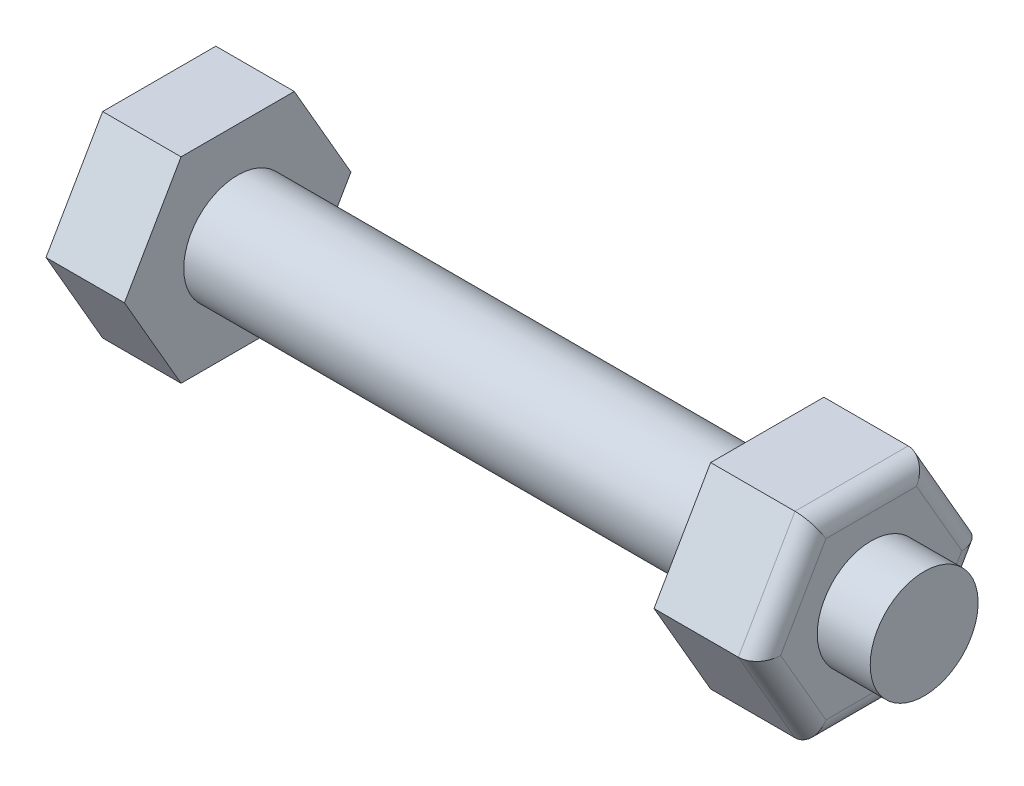
ISO-10303-21;
HEADER;
FILE_DESCRIPTION(('STEP AP214'),'2;1');
FILE_NAME('part.step','',(''),(''),'','','');
FILE_SCHEMA(('AUTOMOTIVE_DESIGN { 1 0 10303 214 1 1 1 1 }'));
ENDSEC;
DATA;
#1=APPLICATION_CONTEXT('core data for automotive mechanical design processes');
#2=APPLICATION_PROTOCOL_DEFINITION('international standard','automotive_design',2000,#1);
#3=PRODUCT_CONTEXT('',#1,'mechanical');
#4=PRODUCT('Part','Part','',(#3));
#5=PRODUCT_RELATED_PRODUCT_CATEGORY('part','',(#4));
#6=PRODUCT_DEFINITION_FORMATION('','',#4);
#7=PRODUCT_DEFINITION_CONTEXT('part definition',#1,'design');
#8=PRODUCT_DEFINITION('design','',#6,#7);
#9=PRODUCT_DEFINITION_SHAPE('','',#8);
#10=(LENGTH_UNIT() NAMED_UNIT(*) SI_UNIT(.MILLI.,.METRE.));
#11=(NAMED_UNIT(*) PLANE_ANGLE_UNIT() SI_UNIT($,.RADIAN.));
#12=(NAMED_UNIT(*) SI_UNIT($,.STERADIAN.) SOLID_ANGLE_UNIT());
#13=UNCERTAINTY_MEASURE_WITH_UNIT(LENGTH_MEASURE(1.E-05),#10,'distance_accuracy_value','');
#14=(GEOMETRIC_REPRESENTATION_CONTEXT(3) GLOBAL_UNCERTAINTY_ASSIGNED_CONTEXT((#13)) GLOBAL_UNIT_ASSIGNED_CONTEXT((#10,
#11,#12)) REPRESENTATION_CONTEXT('',''));
#15=CARTESIAN_POINT('',(0.,0.,0.));
#16=DIRECTION('',(0.,0.,1.));
#17=DIRECTION('',(1.,0.,0.));
#18=AXIS2_PLACEMENT_3D('',#15,#16,#17);
#19=CARTESIAN_POINT('',(0.,0.,0.));
#20=DIRECTION('',(-1.,0.,0.));
#21=DIRECTION('',(0.,0.,1.));
#22=AXIS2_PLACEMENT_3D('',#19,#20,#21);
#23=CYLINDRICAL_SURFACE('',#22,2.75);
#24=CARTESIAN_POINT('',(0.,0.,0.));
#25=DIRECTION('',(-1.,0.,0.));
#26=DIRECTION('',(0.,0.,1.));
#27=AXIS2_PLACEMENT_3D('',#24,#25,#26);
#28=CIRCLE('',#27,2.75);
#29=CARTESIAN_POINT('',(0.,0.,2.75));
#30=VERTEX_POINT('',#29);
#31=EDGE_CURVE('E286',#30,#30,#28,.T.);
#32=ORIENTED_EDGE('',*,*,#31,.F.);
#33=EDGE_LOOP('',(#32));
#34=FACE_BOUND('',#33,.T.);
#35=CARTESIAN_POINT('',(27.,0.,0.));
#36=DIRECTION('',(1.,0.,0.));
#37=DIRECTION('',(0.,0.,-1.));
#38=AXIS2_PLACEMENT_3D('',#35,#36,#37);
#39=CIRCLE('',#38,2.75);
#40=CARTESIAN_POINT('',(27.,0.,-2.75));
#41=VERTEX_POINT('',#40);
#42=EDGE_CURVE('E290',#41,#41,#39,.T.);
#43=ORIENTED_EDGE('',*,*,#42,.F.);
#44=EDGE_LOOP('',(#43));
#45=FACE_BOUND('',#44,.T.);
#46=ADVANCED_FACE('F45',(#34,#45),#23,.T.);
#47=CARTESIAN_POINT('',(-4.,-5.,-2.88675134594813));
#48=DIRECTION('',(0.,-0.5,-0.866025403784439));
#49=DIRECTION('',(0.,0.866025403784439,-0.5));
#50=AXIS2_PLACEMENT_3D('',#47,#48,#49);
#51=PLANE('',#50);
#52=DIRECTION('',(0.,0.866025403784439,-0.5));
#53=VECTOR('',#52,1.);
#54=CARTESIAN_POINT('',(0.,-5.,-2.88675134594813));
#55=LINE('',#54,#53);
#56=CARTESIAN_POINT('',(0.,-5.,-2.88675134594813));
#57=VERTEX_POINT('',#56);
#58=CARTESIAN_POINT('',(0.,0.,-5.77350269189626));
#59=VERTEX_POINT('',#58);
#60=EDGE_CURVE('E242',#57,#59,#55,.T.);
#61=ORIENTED_EDGE('',*,*,#60,.F.);
#62=DIRECTION('',(1.,0.,0.));
#63=VECTOR('',#62,1.);
#64=CARTESIAN_POINT('',(-4.,-5.,-2.88675134594813));
#65=LINE('',#64,#63);
#66=CARTESIAN_POINT('',(-4.,-5.,-2.88675134594813));
#67=VERTEX_POINT('',#66);
#68=EDGE_CURVE('E265',#67,#57,#65,.T.);
#69=ORIENTED_EDGE('',*,*,#68,.F.);
#70=DIRECTION('',(0.,0.866025403784439,-0.5));
#71=VECTOR('',#70,1.);
#72=CARTESIAN_POINT('',(-4.,-5.,-2.88675134594813));
#73=LINE('',#72,#71);
#74=CARTESIAN_POINT('',(-4.,0.,-5.77350269189626));
#75=VERTEX_POINT('',#74);
#76=EDGE_CURVE('E216',#67,#75,#73,.T.);
#77=ORIENTED_EDGE('',*,*,#76,.T.);
#78=DIRECTION('',(1.,0.,0.));
#79=VECTOR('',#78,1.);
#80=CARTESIAN_POINT('',(-4.,0.,-5.77350269189626));
#81=LINE('',#80,#79);
#82=EDGE_CURVE('E241',#75,#59,#81,.T.);
#83=ORIENTED_EDGE('',*,*,#82,.T.);
#84=EDGE_LOOP('',(#61,#69,#77,#83));
#85=FACE_BOUND('',#84,.T.);
#86=ADVANCED_FACE('F385',(#85),#51,.T.);
#87=CARTESIAN_POINT('',(-4.,-5.,2.88675134594813));
#88=DIRECTION('',(0.,-1.,0.));
#89=DIRECTION('',(0.,0.,-1.));
#90=AXIS2_PLACEMENT_3D('',#87,#88,#89);
#91=PLANE('',#90);
#92=DIRECTION('',(0.,0.,-1.));
#93=VECTOR('',#92,1.);
#94=CARTESIAN_POINT('',(0.,-5.,2.88675134594813));
#95=LINE('',#94,#93);
#96=CARTESIAN_POINT('',(0.,-5.,2.88675134594813));
#97=VERTEX_POINT('',#96);
#98=EDGE_CURVE('E221',#97,#57,#95,.T.);
#99=ORIENTED_EDGE('',*,*,#98,.F.);
#100=DIRECTION('',(1.,0.,0.));
#101=VECTOR('',#100,1.);
#102=CARTESIAN_POINT('',(-4.,-5.,2.88675134594813));
#103=LINE('',#102,#101);
#104=CARTESIAN_POINT('',(-4.,-5.,2.88675134594813));
#105=VERTEX_POINT('',#104);
#106=EDGE_CURVE('E269',#105,#97,#103,.T.);
#107=ORIENTED_EDGE('',*,*,#106,.F.);
#108=DIRECTION('',(0.,0.,-1.));
#109=VECTOR('',#108,1.);
#110=CARTESIAN_POINT('',(-4.,-5.,2.88675134594813));
#111=LINE('',#110,#109);
#112=EDGE_CURVE('E237',#105,#67,#111,.T.);
#113=ORIENTED_EDGE('',*,*,#112,.T.);
#114=ORIENTED_EDGE('',*,*,#68,.T.);
#115=EDGE_LOOP('',(#99,#107,#113,#114));
#116=FACE_BOUND('',#115,.T.);
#117=ADVANCED_FACE('F391',(#116),#91,.T.);
#118=CARTESIAN_POINT('',(-4.,0.,5.77350269189626));
#119=DIRECTION('',(0.,-0.5,0.866025403784439));
#120=DIRECTION('',(0.,-0.866025403784439,-0.5));
#121=AXIS2_PLACEMENT_3D('',#118,#119,#120);
#122=PLANE('',#121);
#123=DIRECTION('',(0.,-0.866025403784439,-0.5));
#124=VECTOR('',#123,1.);
#125=CARTESIAN_POINT('',(0.,0.,5.77350269189626));
#126=LINE('',#125,#124);
#127=CARTESIAN_POINT('',(0.,0.,5.77350269189626));
#128=VERTEX_POINT('',#127);
#129=EDGE_CURVE('E258',#128,#97,#126,.T.);
#130=ORIENTED_EDGE('',*,*,#129,.F.);
#131=DIRECTION('',(1.,0.,0.));
#132=VECTOR('',#131,1.);
#133=CARTESIAN_POINT('',(-4.,0.,5.77350269189626));
#134=LINE('',#133,#132);
#135=CARTESIAN_POINT('',(-4.,0.,5.77350269189626));
#136=VERTEX_POINT('',#135);
#137=EDGE_CURVE('E272',#136,#128,#134,.T.);
#138=ORIENTED_EDGE('',*,*,#137,.F.);
#139=DIRECTION('',(0.,-0.866025403784439,-0.5));
#140=VECTOR('',#139,1.);
#141=CARTESIAN_POINT('',(-4.,0.,5.77350269189626));
#142=LINE('',#141,#140);
#143=EDGE_CURVE('E233',#136,#105,#142,.T.);
#144=ORIENTED_EDGE('',*,*,#143,.T.);
#145=ORIENTED_EDGE('',*,*,#106,.T.);
#146=EDGE_LOOP('',(#130,#138,#144,#145));
#147=FACE_BOUND('',#146,.T.);
#148=ADVANCED_FACE('F441',(#147),#122,.T.);
#149=CARTESIAN_POINT('',(-4.,5.,2.88675134594813));
#150=DIRECTION('',(0.,0.5,0.866025403784439));
#151=DIRECTION('',(0.,-0.866025403784439,0.5));
#152=AXIS2_PLACEMENT_3D('',#149,#150,#151);
#153=PLANE('',#152);
#154=DIRECTION('',(0.,-0.866025403784439,0.5));
#155=VECTOR('',#154,1.);
#156=CARTESIAN_POINT('',(0.,5.,2.88675134594813));
#157=LINE('',#156,#155);
#158=CARTESIAN_POINT('',(0.,5.,2.88675134594813));
#159=VERTEX_POINT('',#158);
#160=EDGE_CURVE('E254',#159,#128,#157,.T.);
#161=ORIENTED_EDGE('',*,*,#160,.F.);
#162=DIRECTION('',(1.,0.,0.));
#163=VECTOR('',#162,1.);
#164=CARTESIAN_POINT('',(-4.,5.,2.88675134594813));
#165=LINE('',#164,#163);
#166=CARTESIAN_POINT('',(-4.,5.,2.88675134594813));
#167=VERTEX_POINT('',#166);
#168=EDGE_CURVE('E275',#167,#159,#165,.T.);
#169=ORIENTED_EDGE('',*,*,#168,.F.);
#170=DIRECTION('',(0.,-0.866025403784439,0.5));
#171=VECTOR('',#170,1.);
#172=CARTESIAN_POINT('',(-4.,5.,2.88675134594813));
#173=LINE('',#172,#171);
#174=EDGE_CURVE('E229',#167,#136,#173,.T.);
#175=ORIENTED_EDGE('',*,*,#174,.T.);
#176=ORIENTED_EDGE('',*,*,#137,.T.);
#177=EDGE_LOOP('',(#161,#169,#175,#176));
#178=FACE_BOUND('',#177,.T.);
#179=ADVANCED_FACE('F445',(#178),#153,.T.);
#180=CARTESIAN_POINT('',(-4.,5.,-2.88675134594813));
#181=DIRECTION('',(0.,1.,0.));
#182=DIRECTION('',(0.,0.,1.));
#183=AXIS2_PLACEMENT_3D('',#180,#181,#182);
#184=PLANE('',#183);
#185=DIRECTION('',(0.,0.,1.));
#186=VECTOR('',#185,1.);
#187=CARTESIAN_POINT('',(0.,5.,-2.88675134594813));
#188=LINE('',#187,#186);
#189=CARTESIAN_POINT('',(0.,5.,-2.88675134594813));
#190=VERTEX_POINT('',#189);
#191=EDGE_CURVE('E250',#190,#159,#188,.T.);
#192=ORIENTED_EDGE('',*,*,#191,.F.);
#193=DIRECTION('',(1.,0.,0.));
#194=VECTOR('',#193,1.);
#195=CARTESIAN_POINT('',(-4.,5.,-2.88675134594813));
#196=LINE('',#195,#194);
#197=CARTESIAN_POINT('',(-4.,5.,-2.88675134594813));
#198=VERTEX_POINT('',#197);
#199=EDGE_CURVE('E278',#198,#190,#196,.T.);
#200=ORIENTED_EDGE('',*,*,#199,.F.);
#201=DIRECTION('',(0.,0.,1.));
#202=VECTOR('',#201,1.);
#203=CARTESIAN_POINT('',(-4.,5.,-2.88675134594813));
#204=LINE('',#203,#202);
#205=EDGE_CURVE('E225',#198,#167,#204,.T.);
#206=ORIENTED_EDGE('',*,*,#205,.T.);
#207=ORIENTED_EDGE('',*,*,#168,.T.);
#208=EDGE_LOOP('',(#192,#200,#206,#207));
#209=FACE_BOUND('',#208,.T.);
#210=ADVANCED_FACE('F449',(#209),#184,.T.);
#211=CARTESIAN_POINT('',(-4.,0.,-5.77350269189626));
#212=DIRECTION('',(0.,0.5,-0.866025403784438));
#213=DIRECTION('',(0.,0.866025403784438,0.5));
#214=AXIS2_PLACEMENT_3D('',#211,#212,#213);
#215=PLANE('',#214);
#216=DIRECTION('',(0.,0.866025403784438,0.5));
#217=VECTOR('',#216,1.);
#218=CARTESIAN_POINT('',(0.,0.,-5.77350269189626));
#219=LINE('',#218,#217);
#220=EDGE_CURVE('E246',#59,#190,#219,.T.);
#221=ORIENTED_EDGE('',*,*,#220,.F.);
#222=ORIENTED_EDGE('',*,*,#82,.F.);
#223=DIRECTION('',(0.,0.866025403784438,0.5));
#224=VECTOR('',#223,1.);
#225=CARTESIAN_POINT('',(-4.,0.,-5.77350269189626));
#226=LINE('',#225,#224);
#227=EDGE_CURVE('E220',#75,#198,#226,.T.);
#228=ORIENTED_EDGE('',*,*,#227,.T.);
#229=ORIENTED_EDGE('',*,*,#199,.T.);
#230=EDGE_LOOP('',(#221,#222,#228,#229));
#231=FACE_BOUND('',#230,.T.);
#232=ADVANCED_FACE('F434',(#231),#215,.T.);
#233=CARTESIAN_POINT('',(-4.,0.,0.));
#234=DIRECTION('',(1.,0.,0.));
#235=DIRECTION('',(0.,0.,-1.));
#236=AXIS2_PLACEMENT_3D('',#233,#234,#235);
#237=PLANE('',#236);
#238=ORIENTED_EDGE('',*,*,#76,.F.);
#239=ORIENTED_EDGE('',*,*,#112,.F.);
#240=ORIENTED_EDGE('',*,*,#143,.F.);
#241=ORIENTED_EDGE('',*,*,#174,.F.);
#242=ORIENTED_EDGE('',*,*,#205,.F.);
#243=ORIENTED_EDGE('',*,*,#227,.F.);
#244=EDGE_LOOP('',(#238,#239,#240,#241,#242,#243));
#245=FACE_BOUND('',#244,.T.);
#246=ADVANCED_FACE('F431',(#245),#237,.F.);
#247=CARTESIAN_POINT('',(0.,0.,0.));
#248=DIRECTION('',(1.,0.,0.));
#249=DIRECTION('',(0.,0.,-1.));
#250=AXIS2_PLACEMENT_3D('',#247,#248,#249);
#251=PLANE('',#250);
#252=ORIENTED_EDGE('',*,*,#31,.T.);
#253=EDGE_LOOP('',(#252));
#254=FACE_BOUND('',#253,.T.);
#255=ORIENTED_EDGE('',*,*,#60,.T.);
#256=ORIENTED_EDGE('',*,*,#220,.T.);
#257=ORIENTED_EDGE('',*,*,#191,.T.);
#258=ORIENTED_EDGE('',*,*,#160,.T.);
#259=ORIENTED_EDGE('',*,*,#129,.T.);
#260=ORIENTED_EDGE('',*,*,#98,.T.);
#261=EDGE_LOOP('',(#255,#256,#257,#258,#259,#260));
#262=FACE_BOUND('',#261,.T.);
#263=ADVANCED_FACE('F430',(#254,#262),#251,.T.);
#264=CARTESIAN_POINT('',(32.3,-5.,-2.88675134594813));
#265=DIRECTION('',(0.,0.5,0.866025403784439));
#266=DIRECTION('',(0.,-0.866025403784439,0.5));
#267=AXIS2_PLACEMENT_3D('',#264,#265,#266);
#268=PLANE('',#267);
#269=DIRECTION('',(-1.,0.,0.));
#270=VECTOR('',#269,1.);
#271=CARTESIAN_POINT('',(32.3,0.,-5.77350269189626));
#272=LINE('',#271,#270);
#273=CARTESIAN_POINT('',(31.3,0.,-5.77350269189626));
#274=VERTEX_POINT('',#273);
#275=CARTESIAN_POINT('',(27.,0.,-5.77350269189626));
#276=VERTEX_POINT('',#275);
#277=EDGE_CURVE('E155',#274,#276,#272,.T.);
#278=ORIENTED_EDGE('',*,*,#277,.F.);
#279=DIRECTION('',(0.,0.866025403784439,-0.5));
#280=VECTOR('',#279,1.);
#281=CARTESIAN_POINT('',(31.3,-5.,-2.88675134594813));
#282=LINE('',#281,#280);
#283=CARTESIAN_POINT('',(31.3,-5.,-2.88675134594813));
#284=VERTEX_POINT('',#283);
#285=EDGE_CURVE('E318',#274,#284,#282,.F.);
#286=ORIENTED_EDGE('',*,*,#285,.T.);
#287=DIRECTION('',(-1.,0.,0.));
#288=VECTOR('',#287,1.);
#289=CARTESIAN_POINT('',(32.3,-5.,-2.88675134594813));
#290=LINE('',#289,#288);
#291=CARTESIAN_POINT('',(27.,-5.,-2.88675134594813));
#292=VERTEX_POINT('',#291);
#293=EDGE_CURVE('E181',#284,#292,#290,.T.);
#294=ORIENTED_EDGE('',*,*,#293,.T.);
#295=DIRECTION('',(0.,0.866025403784439,-0.5));
#296=VECTOR('',#295,1.);
#297=CARTESIAN_POINT('',(27.,-5.,-2.88675134594813));
#298=LINE('',#297,#296);
#299=EDGE_CURVE('E173',#292,#276,#298,.T.);
#300=ORIENTED_EDGE('',*,*,#299,.T.);
#301=EDGE_LOOP('',(#278,#286,#294,#300));
#302=FACE_BOUND('',#301,.T.);
#303=ADVANCED_FACE('F179',(#302),#268,.F.);
#304=CARTESIAN_POINT('',(32.3,0.,-5.77350269189626));
#305=DIRECTION('',(0.,-0.5,0.866025403784438));
#306=DIRECTION('',(0.,-0.866025403784438,-0.5));
#307=AXIS2_PLACEMENT_3D('',#304,#305,#306);
#308=PLANE('',#307);
#309=DIRECTION('',(-1.,0.,0.));
#310=VECTOR('',#309,1.);
#311=CARTESIAN_POINT('',(32.3,5.,-2.88675134594813));
#312=LINE('',#311,#310);
#313=CARTESIAN_POINT('',(31.3,5.,-2.88675134594813));
#314=VERTEX_POINT('',#313);
#315=CARTESIAN_POINT('',(27.,5.,-2.88675134594813));
#316=VERTEX_POINT('',#315);
#317=EDGE_CURVE('E167',#314,#316,#312,.T.);
#318=ORIENTED_EDGE('',*,*,#317,.F.);
#319=DIRECTION('',(0.,0.866025403784438,0.5));
#320=VECTOR('',#319,1.);
#321=CARTESIAN_POINT('',(31.3,0.,-5.77350269189626));
#322=LINE('',#321,#320);
#323=EDGE_CURVE('E162',#314,#274,#322,.F.);
#324=ORIENTED_EDGE('',*,*,#323,.T.);
#325=ORIENTED_EDGE('',*,*,#277,.T.);
#326=DIRECTION('',(0.,0.866025403784438,0.5));
#327=VECTOR('',#326,1.);
#328=CARTESIAN_POINT('',(27.,0.,-5.77350269189626));
#329=LINE('',#328,#327);
#330=EDGE_CURVE('E159',#276,#316,#329,.T.);
#331=ORIENTED_EDGE('',*,*,#330,.T.);
#332=EDGE_LOOP('',(#318,#324,#325,#331));
#333=FACE_BOUND('',#332,.T.);
#334=ADVANCED_FACE('F158',(#333),#308,.F.);
#335=CARTESIAN_POINT('',(32.3,5.,-2.88675134594813));
#336=DIRECTION('',(0.,-1.,0.));
#337=DIRECTION('',(0.,0.,-1.));
#338=AXIS2_PLACEMENT_3D('',#335,#336,#337);
#339=PLANE('',#338);
#340=DIRECTION('',(-1.,0.,0.));
#341=VECTOR('',#340,1.);
#342=CARTESIAN_POINT('',(32.3,5.,2.88675134594813));
#343=LINE('',#342,#341);
#344=CARTESIAN_POINT('',(31.3,5.,2.88675134594813));
#345=VERTEX_POINT('',#344);
#346=CARTESIAN_POINT('',(27.,5.,2.88675134594813));
#347=VERTEX_POINT('',#346);
#348=EDGE_CURVE('E211',#345,#347,#343,.T.);
#349=ORIENTED_EDGE('',*,*,#348,.F.);
#350=DIRECTION('',(0.,0.,1.));
#351=VECTOR('',#350,1.);
#352=CARTESIAN_POINT('',(31.3,5.,-2.88675134594813));
#353=LINE('',#352,#351);
#354=EDGE_CURVE('E11',#345,#314,#353,.F.);
#355=ORIENTED_EDGE('',*,*,#354,.T.);
#356=ORIENTED_EDGE('',*,*,#317,.T.);
#357=DIRECTION('',(0.,0.,1.));
#358=VECTOR('',#357,1.);
#359=CARTESIAN_POINT('',(27.,5.,-2.88675134594813));
#360=LINE('',#359,#358);
#361=EDGE_CURVE('E176',#316,#347,#360,.T.);
#362=ORIENTED_EDGE('',*,*,#361,.T.);
#363=EDGE_LOOP('',(#349,#355,#356,#362));
#364=FACE_BOUND('',#363,.T.);
#365=ADVANCED_FACE('F364',(#364),#339,.F.);
#366=CARTESIAN_POINT('',(32.3,5.,2.88675134594813));
#367=DIRECTION('',(0.,-0.5,-0.866025403784439));
#368=DIRECTION('',(0.,0.866025403784439,-0.5));
#369=AXIS2_PLACEMENT_3D('',#366,#367,#368);
#370=PLANE('',#369);
#371=DIRECTION('',(-1.,0.,0.));
#372=VECTOR('',#371,1.);
#373=CARTESIAN_POINT('',(32.3,0.,5.77350269189626));
#374=LINE('',#373,#372);
#375=CARTESIAN_POINT('',(31.3,0.,5.77350269189626));
#376=VERTEX_POINT('',#375);
#377=CARTESIAN_POINT('',(27.,0.,5.77350269189626));
#378=VERTEX_POINT('',#377);
#379=EDGE_CURVE('E208',#376,#378,#374,.T.);
#380=ORIENTED_EDGE('',*,*,#379,.F.);
#381=DIRECTION('',(0.,-0.866025403784439,0.5));
#382=VECTOR('',#381,1.);
#383=CARTESIAN_POINT('',(31.3,5.,2.88675134594813));
#384=LINE('',#383,#382);
#385=EDGE_CURVE('E55',#376,#345,#384,.F.);
#386=ORIENTED_EDGE('',*,*,#385,.T.);
#387=ORIENTED_EDGE('',*,*,#348,.T.);
#388=DIRECTION('',(0.,-0.866025403784439,0.5));
#389=VECTOR('',#388,1.);
#390=CARTESIAN_POINT('',(27.,5.,2.88675134594813));
#391=LINE('',#390,#389);
#392=EDGE_CURVE('E192',#347,#378,#391,.T.);
#393=ORIENTED_EDGE('',*,*,#392,.T.);
#394=EDGE_LOOP('',(#380,#386,#387,#393));
#395=FACE_BOUND('',#394,.T.);
#396=ADVANCED_FACE('F421',(#395),#370,.F.);
#397=CARTESIAN_POINT('',(32.3,0.,5.77350269189626));
#398=DIRECTION('',(0.,0.5,-0.866025403784438));
#399=DIRECTION('',(0.,0.866025403784438,0.5));
#400=AXIS2_PLACEMENT_3D('',#397,#398,#399);
#401=PLANE('',#400);
#402=DIRECTION('',(-1.,0.,0.));
#403=VECTOR('',#402,1.);
#404=CARTESIAN_POINT('',(32.3,-5.,2.88675134594813));
#405=LINE('',#404,#403);
#406=CARTESIAN_POINT('',(31.3,-5.,2.88675134594813));
#407=VERTEX_POINT('',#406);
#408=CARTESIAN_POINT('',(27.,-5.,2.88675134594813));
#409=VERTEX_POINT('',#408);
#410=EDGE_CURVE('E205',#407,#409,#405,.T.);
#411=ORIENTED_EDGE('',*,*,#410,.F.);
#412=DIRECTION('',(0.,-0.866025403784438,-0.5));
#413=VECTOR('',#412,1.);
#414=CARTESIAN_POINT('',(31.3,0.,5.77350269189626));
#415=LINE('',#414,#413);
#416=EDGE_CURVE('E70',#407,#376,#415,.F.);
#417=ORIENTED_EDGE('',*,*,#416,.T.);
#418=ORIENTED_EDGE('',*,*,#379,.T.);
#419=DIRECTION('',(0.,-0.866025403784438,-0.5));
#420=VECTOR('',#419,1.);
#421=CARTESIAN_POINT('',(27.,0.,5.77350269189626));
#422=LINE('',#421,#420);
#423=EDGE_CURVE('E196',#378,#409,#422,.T.);
#424=ORIENTED_EDGE('',*,*,#423,.T.);
#425=EDGE_LOOP('',(#411,#417,#418,#424));
#426=FACE_BOUND('',#425,.T.);
#427=ADVANCED_FACE('F416',(#426),#401,.F.);
#428=CARTESIAN_POINT('',(32.3,-5.,2.88675134594813));
#429=DIRECTION('',(0.,1.,0.));
#430=DIRECTION('',(0.,0.,1.));
#431=AXIS2_PLACEMENT_3D('',#428,#429,#430);
#432=PLANE('',#431);
#433=ORIENTED_EDGE('',*,*,#293,.F.);
#434=DIRECTION('',(0.,0.,-1.));
#435=VECTOR('',#434,1.);
#436=CARTESIAN_POINT('',(31.3,-5.,2.88675134594813));
#437=LINE('',#436,#435);
#438=EDGE_CURVE('E321',#284,#407,#437,.F.);
#439=ORIENTED_EDGE('',*,*,#438,.T.);
#440=ORIENTED_EDGE('',*,*,#410,.T.);
#441=DIRECTION('',(0.,0.,-1.));
#442=VECTOR('',#441,1.);
#443=CARTESIAN_POINT('',(27.,-5.,2.88675134594813));
#444=LINE('',#443,#442);
#445=EDGE_CURVE('E200',#409,#292,#444,.T.);
#446=ORIENTED_EDGE('',*,*,#445,.T.);
#447=EDGE_LOOP('',(#433,#439,#440,#446));
#448=FACE_BOUND('',#447,.T.);
#449=ADVANCED_FACE('F374',(#448),#432,.F.);
#450=CARTESIAN_POINT('',(32.3,0.,0.));
#451=DIRECTION('',(1.,0.,0.));
#452=DIRECTION('',(0.,0.,-1.));
#453=AXIS2_PLACEMENT_3D('',#450,#451,#452);
#454=PLANE('',#453);
#455=DIRECTION('',(0.,0.866025403784439,-0.5));
#456=VECTOR('',#455,1.);
#457=CARTESIAN_POINT('',(32.3,0.499999999999997,-4.90747728811182));
#458=LINE('',#457,#456);
#459=CARTESIAN_POINT('',(32.3,-4.,-2.30940107675851));
#460=VERTEX_POINT('',#459);
#461=CARTESIAN_POINT('',(32.3,0.,-4.61880215351701));
#462=VERTEX_POINT('',#461);
#463=EDGE_CURVE('E309',#460,#462,#458,.T.);
#464=ORIENTED_EDGE('',*,*,#463,.T.);
#465=DIRECTION('',(0.,0.866025403784438,0.5));
#466=VECTOR('',#465,1.);
#467=CARTESIAN_POINT('',(32.3,4.5,-2.02072594216369));
#468=LINE('',#467,#466);
#469=CARTESIAN_POINT('',(32.3,4.,-2.3094010767585));
#470=VERTEX_POINT('',#469);
#471=EDGE_CURVE('E312',#462,#470,#468,.T.);
#472=ORIENTED_EDGE('',*,*,#471,.T.);
#473=DIRECTION('',(0.,0.,1.));
#474=VECTOR('',#473,1.);
#475=CARTESIAN_POINT('',(32.3,4.,2.88675134594813));
#476=LINE('',#475,#474);
#477=CARTESIAN_POINT('',(32.3,4.,2.3094010767585));
#478=VERTEX_POINT('',#477);
#479=EDGE_CURVE('E294',#470,#478,#476,.T.);
#480=ORIENTED_EDGE('',*,*,#479,.T.);
#481=DIRECTION('',(0.,-0.866025403784439,0.5));
#482=VECTOR('',#481,1.);
#483=CARTESIAN_POINT('',(32.3,-0.5,4.90747728811182));
#484=LINE('',#483,#482);
#485=CARTESIAN_POINT('',(32.3,0.,4.61880215351701));
#486=VERTEX_POINT('',#485);
#487=EDGE_CURVE('E300',#478,#486,#484,.T.);
#488=ORIENTED_EDGE('',*,*,#487,.T.);
#489=DIRECTION('',(0.,-0.866025403784438,-0.5));
#490=VECTOR('',#489,1.);
#491=CARTESIAN_POINT('',(32.3,-4.5,2.02072594216369));
#492=LINE('',#491,#490);
#493=CARTESIAN_POINT('',(32.3,-4.,2.3094010767585));
#494=VERTEX_POINT('',#493);
#495=EDGE_CURVE('E303',#486,#494,#492,.T.);
#496=ORIENTED_EDGE('',*,*,#495,.T.);
#497=DIRECTION('',(0.,0.,-1.));
#498=VECTOR('',#497,1.);
#499=CARTESIAN_POINT('',(32.3,-4.,-2.88675134594813));
#500=LINE('',#499,#498);
#501=EDGE_CURVE('E306',#494,#460,#500,.T.);
#502=ORIENTED_EDGE('',*,*,#501,.T.);
#503=EDGE_LOOP('',(#464,#472,#480,#488,#496,#502));
#504=FACE_BOUND('',#503,.T.);
#505=CARTESIAN_POINT('',(32.3,0.,0.));
#506=DIRECTION('',(1.,0.,0.));
#507=DIRECTION('',(0.,0.,-1.));
#508=AXIS2_PLACEMENT_3D('',#505,#506,#507);
#509=CIRCLE('',#508,2.75);
#510=CARTESIAN_POINT('',(32.3,0.,-2.75));
#511=VERTEX_POINT('',#510);
#512=EDGE_CURVE('E166',#511,#511,#509,.T.);
#513=ORIENTED_EDGE('',*,*,#512,.F.);
#514=EDGE_LOOP('',(#513));
#515=FACE_BOUND('',#514,.T.);
#516=ADVANCED_FACE('F354',(#504,#515),#454,.T.);
#517=CARTESIAN_POINT('',(27.,0.,0.));
#518=DIRECTION('',(1.,0.,0.));
#519=DIRECTION('',(0.,0.,-1.));
#520=AXIS2_PLACEMENT_3D('',#517,#518,#519);
#521=PLANE('',#520);
#522=ORIENTED_EDGE('',*,*,#42,.T.);
#523=EDGE_LOOP('',(#522));
#524=FACE_BOUND('',#523,.T.);
#525=ORIENTED_EDGE('',*,*,#299,.F.);
#526=ORIENTED_EDGE('',*,*,#445,.F.);
#527=ORIENTED_EDGE('',*,*,#423,.F.);
#528=ORIENTED_EDGE('',*,*,#392,.F.);
#529=ORIENTED_EDGE('',*,*,#361,.F.);
#530=ORIENTED_EDGE('',*,*,#330,.F.);
#531=EDGE_LOOP('',(#525,#526,#527,#528,#529,#530));
#532=FACE_BOUND('',#531,.T.);
#533=ADVANCED_FACE('F171',(#524,#532),#521,.F.);
#534=CARTESIAN_POINT('',(35.,2.75,0.));
#535=DIRECTION('',(-1.,0.,0.));
#536=DIRECTION('',(0.,0.,1.));
#537=AXIS2_PLACEMENT_3D('',#534,#535,#536);
#538=PLANE('',#537);
#539=CARTESIAN_POINT('',(35.,0.,0.));
#540=DIRECTION('',(-1.,0.,0.));
#541=DIRECTION('',(0.,0.,1.));
#542=AXIS2_PLACEMENT_3D('',#539,#540,#541);
#543=CIRCLE('',#542,2.75);
#544=CARTESIAN_POINT('',(35.,0.,2.75));
#545=VERTEX_POINT('',#544);
#546=EDGE_CURVE('E268',#545,#545,#543,.T.);
#547=ORIENTED_EDGE('',*,*,#546,.F.);
#548=EDGE_LOOP('',(#547));
#549=FACE_BOUND('',#548,.T.);
#550=ADVANCED_FACE('F399',(#549),#538,.F.);
#551=ORIENTED_EDGE('',*,*,#512,.T.);
#552=EDGE_LOOP('',(#551));
#553=FACE_BOUND('',#552,.T.);
#554=ORIENTED_EDGE('',*,*,#546,.T.);
#555=EDGE_LOOP('',(#554));
#556=FACE_BOUND('',#555,.T.);
#557=ADVANCED_FACE('F383',(#553,#556),#23,.T.);
#558=CARTESIAN_POINT('',(31.3,-2.,3.46410161513775));
#559=DIRECTION('',(0.,0.866025403784438,0.5));
#560=DIRECTION('',(0.,-0.5,0.866025403784438));
#561=AXIS2_PLACEMENT_3D('',#558,#559,#560);
#562=CYLINDRICAL_SURFACE('',#561,1.);
#563=CARTESIAN_POINT('',(31.3,0.,4.61880215351701));
#564=DIRECTION('',(0.,1.,0.));
#565=DIRECTION('',(0.,0.,-1.));
#566=AXIS2_PLACEMENT_3D('',#563,#564,#565);
#567=ELLIPSE('',#566,1.15470053837925,1.);
#568=EDGE_CURVE('E188',#376,#486,#567,.T.);
#569=ORIENTED_EDGE('',*,*,#568,.F.);
#570=ORIENTED_EDGE('',*,*,#416,.F.);
#571=CARTESIAN_POINT('',(31.3,-4.,2.3094010767585));
#572=DIRECTION('',(0.,0.5,0.866025403784439));
#573=DIRECTION('',(0.,0.866025403784439,-0.5));
#574=AXIS2_PLACEMENT_3D('',#571,#572,#573);
#575=ELLIPSE('',#574,1.15470053837925,1.);
#576=EDGE_CURVE('E49',#494,#407,#575,.F.);
#577=ORIENTED_EDGE('',*,*,#576,.F.);
#578=ORIENTED_EDGE('',*,*,#495,.F.);
#579=EDGE_LOOP('',(#569,#570,#577,#578));
#580=FACE_BOUND('',#579,.T.);
#581=ADVANCED_FACE('F47',(#580),#562,.T.);
#582=CARTESIAN_POINT('',(31.3,-4.,0.));
#583=DIRECTION('',(0.,0.,1.));
#584=DIRECTION('',(1.,0.,0.));
#585=AXIS2_PLACEMENT_3D('',#582,#583,#584);
#586=CYLINDRICAL_SURFACE('',#585,1.);
#587=ORIENTED_EDGE('',*,*,#576,.T.);
#588=ORIENTED_EDGE('',*,*,#438,.F.);
#589=CARTESIAN_POINT('',(31.3,-4.,-2.3094010767585));
#590=DIRECTION('',(0.,-0.5,0.866025403784439));
#591=DIRECTION('',(0.,0.866025403784439,0.5));
#592=AXIS2_PLACEMENT_3D('',#589,#590,#591);
#593=ELLIPSE('',#592,1.15470053837925,1.);
#594=EDGE_CURVE('E338',#460,#284,#593,.F.);
#595=ORIENTED_EDGE('',*,*,#594,.F.);
#596=ORIENTED_EDGE('',*,*,#501,.F.);
#597=EDGE_LOOP('',(#587,#588,#595,#596));
#598=FACE_BOUND('',#597,.T.);
#599=ADVANCED_FACE('F376',(#598),#586,.T.);
#600=CARTESIAN_POINT('',(31.3,2.,3.46410161513775));
#601=DIRECTION('',(0.,0.866025403784439,-0.5));
#602=DIRECTION('',(0.,0.5,0.866025403784439));
#603=AXIS2_PLACEMENT_3D('',#600,#601,#602);
#604=CYLINDRICAL_SURFACE('',#603,1.);
#605=ORIENTED_EDGE('',*,*,#568,.T.);
#606=ORIENTED_EDGE('',*,*,#487,.F.);
#607=CARTESIAN_POINT('',(31.3,4.,2.3094010767585));
#608=DIRECTION('',(0.,0.5,-0.866025403784439));
#609=DIRECTION('',(0.,-0.866025403784439,-0.5));
#610=AXIS2_PLACEMENT_3D('',#607,#608,#609);
#611=ELLIPSE('',#610,1.15470053837925,1.);
#612=EDGE_CURVE('E334',#345,#478,#611,.T.);
#613=ORIENTED_EDGE('',*,*,#612,.F.);
#614=ORIENTED_EDGE('',*,*,#385,.F.);
#615=EDGE_LOOP('',(#605,#606,#613,#614));
#616=FACE_BOUND('',#615,.T.);
#617=ADVANCED_FACE('F347',(#616),#604,.T.);
#618=CARTESIAN_POINT('',(31.3,-2.,-3.46410161513776));
#619=DIRECTION('',(0.,-0.866025403784439,0.5));
#620=DIRECTION('',(0.,-0.5,-0.866025403784439));
#621=AXIS2_PLACEMENT_3D('',#618,#619,#620);
#622=CYLINDRICAL_SURFACE('',#621,1.);
#623=ORIENTED_EDGE('',*,*,#594,.T.);
#624=ORIENTED_EDGE('',*,*,#285,.F.);
#625=CARTESIAN_POINT('',(31.3,0.,-4.61880215351701));
#626=DIRECTION('',(0.,-1.,0.));
#627=DIRECTION('',(0.,0.,1.));
#628=AXIS2_PLACEMENT_3D('',#625,#626,#627);
#629=ELLIPSE('',#628,1.15470053837925,1.);
#630=EDGE_CURVE('E331',#462,#274,#629,.F.);
#631=ORIENTED_EDGE('',*,*,#630,.F.);
#632=ORIENTED_EDGE('',*,*,#463,.F.);
#633=EDGE_LOOP('',(#623,#624,#631,#632));
#634=FACE_BOUND('',#633,.T.);
#635=ADVANCED_FACE('F371',(#634),#622,.T.);
#636=CARTESIAN_POINT('',(31.3,4.,0.));
#637=DIRECTION('',(0.,0.,-1.));
#638=DIRECTION('',(0.,1.,0.));
#639=AXIS2_PLACEMENT_3D('',#636,#637,#638);
#640=CYLINDRICAL_SURFACE('',#639,1.);
#641=ORIENTED_EDGE('',*,*,#612,.T.);
#642=ORIENTED_EDGE('',*,*,#479,.F.);
#643=CARTESIAN_POINT('',(31.3,4.,-2.3094010767585));
#644=DIRECTION('',(0.,-0.5,-0.866025403784439));
#645=DIRECTION('',(0.,0.866025403784439,-0.5));
#646=AXIS2_PLACEMENT_3D('',#643,#644,#645);
#647=ELLIPSE('',#646,1.15470053837925,1.);
#648=EDGE_CURVE('E328',#314,#470,#647,.T.);
#649=ORIENTED_EDGE('',*,*,#648,.F.);
#650=ORIENTED_EDGE('',*,*,#354,.F.);
#651=EDGE_LOOP('',(#641,#642,#649,#650));
#652=FACE_BOUND('',#651,.T.);
#653=ADVANCED_FACE('F361',(#652),#640,.T.);
#654=CARTESIAN_POINT('',(31.3,2.,-3.46410161513775));
#655=DIRECTION('',(0.,-0.866025403784438,-0.5));
#656=DIRECTION('',(0.,0.5,-0.866025403784438));
#657=AXIS2_PLACEMENT_3D('',#654,#655,#656);
#658=CYLINDRICAL_SURFACE('',#657,1.);
#659=ORIENTED_EDGE('',*,*,#630,.T.);
#660=ORIENTED_EDGE('',*,*,#323,.F.);
#661=ORIENTED_EDGE('',*,*,#648,.T.);
#662=ORIENTED_EDGE('',*,*,#471,.F.);
#663=EDGE_LOOP('',(#659,#660,#661,#662));
#664=FACE_BOUND('',#663,.T.);
#665=ADVANCED_FACE('F366',(#664),#658,.T.);
#666=CLOSED_SHELL('',(#46,#86,#117,#148,#179,#210,#232,#246,#263,#303,#334,#365,#396,#427,#449,
#516,#533,#550,#557,#581,#599,#617,#635,#653,#665));
#667=MANIFOLD_SOLID_BREP('B2',#666);
#668=ADVANCED_BREP_SHAPE_REPRESENTATION('',(#18,#667),#14);
#669=SHAPE_DEFINITION_REPRESENTATION(#9,#668);
ENDSEC;
END-ISO-10303-21;
